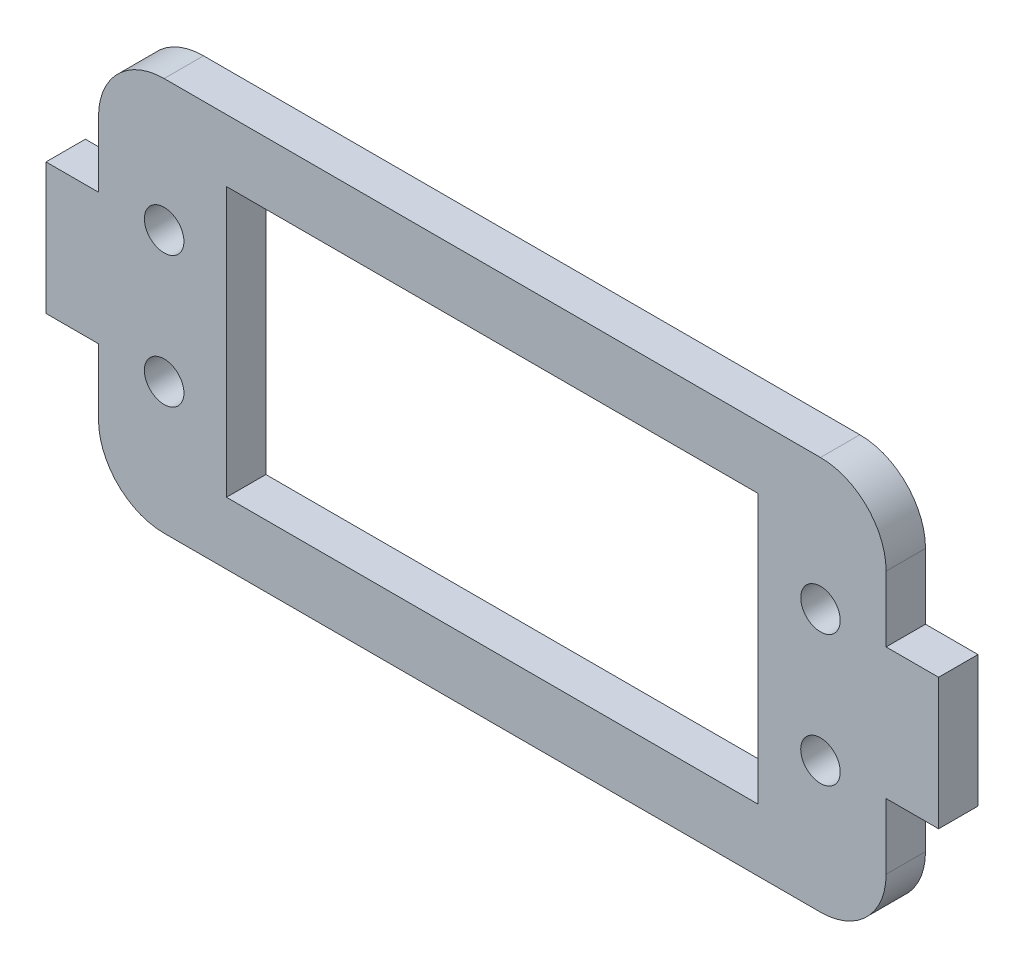
ISO-10303-21;
HEADER;
FILE_DESCRIPTION(('STEP AP214'),'2;1');
FILE_NAME('part.step','',(''),(''),'','','');
FILE_SCHEMA(('AUTOMOTIVE_DESIGN { 1 0 10303 214 1 1 1 1 }'));
ENDSEC;
DATA;
#1=APPLICATION_CONTEXT('core data for automotive mechanical design processes');
#2=APPLICATION_PROTOCOL_DEFINITION('international standard','automotive_design',2000,#1);
#3=PRODUCT_CONTEXT('',#1,'mechanical');
#4=PRODUCT('Part','Part','',(#3));
#5=PRODUCT_RELATED_PRODUCT_CATEGORY('part','',(#4));
#6=PRODUCT_DEFINITION_FORMATION('','',#4);
#7=PRODUCT_DEFINITION_CONTEXT('part definition',#1,'design');
#8=PRODUCT_DEFINITION('design','',#6,#7);
#9=PRODUCT_DEFINITION_SHAPE('','',#8);
#10=(LENGTH_UNIT() NAMED_UNIT(*) SI_UNIT(.MILLI.,.METRE.));
#11=(NAMED_UNIT(*) PLANE_ANGLE_UNIT() SI_UNIT($,.RADIAN.));
#12=(NAMED_UNIT(*) SI_UNIT($,.STERADIAN.) SOLID_ANGLE_UNIT());
#13=UNCERTAINTY_MEASURE_WITH_UNIT(LENGTH_MEASURE(1.E-05),#10,'distance_accuracy_value','');
#14=(GEOMETRIC_REPRESENTATION_CONTEXT(3) GLOBAL_UNCERTAINTY_ASSIGNED_CONTEXT((#13)) GLOBAL_UNIT_ASSIGNED_CONTEXT((#10,
#11,#12)) REPRESENTATION_CONTEXT('',''));
#15=CARTESIAN_POINT('',(0.,0.,0.));
#16=DIRECTION('',(0.,0.,1.));
#17=DIRECTION('',(1.,0.,0.));
#18=AXIS2_PLACEMENT_3D('',#15,#16,#17);
#19=CARTESIAN_POINT('',(30.,-4.99999999999998,3.));
#20=DIRECTION('',(-1.,0.,0.));
#21=DIRECTION('',(0.,0.,1.));
#22=AXIS2_PLACEMENT_3D('',#19,#20,#21);
#23=PLANE('',#22);
#24=DIRECTION('',(0.,1.,0.));
#25=VECTOR('',#24,1.);
#26=CARTESIAN_POINT('',(30.,-4.99999999999998,3.));
#27=LINE('',#26,#25);
#28=CARTESIAN_POINT('',(30.,-10.,3.));
#29=VERTEX_POINT('',#28);
#30=CARTESIAN_POINT('',(30.,-4.99999999999998,3.));
#31=VERTEX_POINT('',#30);
#32=EDGE_CURVE('E238',#29,#31,#27,.T.);
#33=ORIENTED_EDGE('',*,*,#32,.F.);
#34=DIRECTION('',(0.,0.,-1.));
#35=VECTOR('',#34,1.);
#36=CARTESIAN_POINT('',(30.,-10.,3.));
#37=LINE('',#36,#35);
#38=CARTESIAN_POINT('',(30.,-10.,0.));
#39=VERTEX_POINT('',#38);
#40=EDGE_CURVE('E346',#29,#39,#37,.T.);
#41=ORIENTED_EDGE('',*,*,#40,.T.);
#42=DIRECTION('',(0.,1.,0.));
#43=VECTOR('',#42,1.);
#44=CARTESIAN_POINT('',(30.,-4.99999999999998,0.));
#45=LINE('',#44,#43);
#46=CARTESIAN_POINT('',(30.,-4.99999999999998,0.));
#47=VERTEX_POINT('',#46);
#48=EDGE_CURVE('E205',#39,#47,#45,.T.);
#49=ORIENTED_EDGE('',*,*,#48,.T.);
#50=DIRECTION('',(0.,0.,-1.));
#51=VECTOR('',#50,1.);
#52=CARTESIAN_POINT('',(30.,-4.99999999999998,3.));
#53=LINE('',#52,#51);
#54=EDGE_CURVE('E342',#31,#47,#53,.T.);
#55=ORIENTED_EDGE('',*,*,#54,.F.);
#56=EDGE_LOOP('',(#33,#41,#49,#55));
#57=FACE_BOUND('',#56,.T.);
#58=ADVANCED_FACE('F42',(#57),#23,.F.);
#59=CARTESIAN_POINT('',(30.,-4.99999999999998,3.));
#60=DIRECTION('',(0.,1.,0.));
#61=DIRECTION('',(0.,0.,1.));
#62=AXIS2_PLACEMENT_3D('',#59,#60,#61);
#63=PLANE('',#62);
#64=DIRECTION('',(1.,0.,0.));
#65=VECTOR('',#64,1.);
#66=CARTESIAN_POINT('',(30.,-4.99999999999998,0.));
#67=LINE('',#66,#65);
#68=CARTESIAN_POINT('',(34.,-4.99999999999998,0.));
#69=VERTEX_POINT('',#68);
#70=EDGE_CURVE('E280',#47,#69,#67,.T.);
#71=ORIENTED_EDGE('',*,*,#70,.T.);
#72=DIRECTION('',(0.,0.,-1.));
#73=VECTOR('',#72,1.);
#74=CARTESIAN_POINT('',(34.,-4.99999999999998,3.));
#75=LINE('',#74,#73);
#76=CARTESIAN_POINT('',(34.,-4.99999999999998,3.));
#77=VERTEX_POINT('',#76);
#78=EDGE_CURVE('E338',#77,#69,#75,.T.);
#79=ORIENTED_EDGE('',*,*,#78,.F.);
#80=DIRECTION('',(1.,0.,0.));
#81=VECTOR('',#80,1.);
#82=CARTESIAN_POINT('',(30.,-4.99999999999998,3.));
#83=LINE('',#82,#81);
#84=EDGE_CURVE('E241',#31,#77,#83,.T.);
#85=ORIENTED_EDGE('',*,*,#84,.F.);
#86=ORIENTED_EDGE('',*,*,#54,.T.);
#87=EDGE_LOOP('',(#71,#79,#85,#86));
#88=FACE_BOUND('',#87,.T.);
#89=ADVANCED_FACE('F449',(#88),#63,.F.);
#90=CARTESIAN_POINT('',(34.,-4.99999999999998,3.));
#91=DIRECTION('',(-1.,0.,0.));
#92=DIRECTION('',(0.,0.,1.));
#93=AXIS2_PLACEMENT_3D('',#90,#91,#92);
#94=PLANE('',#93);
#95=DIRECTION('',(0.,1.,0.));
#96=VECTOR('',#95,1.);
#97=CARTESIAN_POINT('',(34.,-4.99999999999998,0.));
#98=LINE('',#97,#96);
#99=CARTESIAN_POINT('',(34.,5.00000000000002,0.));
#100=VERTEX_POINT('',#99);
#101=EDGE_CURVE('E283',#69,#100,#98,.T.);
#102=ORIENTED_EDGE('',*,*,#101,.T.);
#103=DIRECTION('',(0.,0.,-1.));
#104=VECTOR('',#103,1.);
#105=CARTESIAN_POINT('',(34.,5.00000000000002,3.));
#106=LINE('',#105,#104);
#107=CARTESIAN_POINT('',(34.,5.00000000000002,3.));
#108=VERTEX_POINT('',#107);
#109=EDGE_CURVE('E334',#108,#100,#106,.T.);
#110=ORIENTED_EDGE('',*,*,#109,.F.);
#111=DIRECTION('',(0.,1.,0.));
#112=VECTOR('',#111,1.);
#113=CARTESIAN_POINT('',(34.,-4.99999999999998,3.));
#114=LINE('',#113,#112);
#115=EDGE_CURVE('E245',#77,#108,#114,.T.);
#116=ORIENTED_EDGE('',*,*,#115,.F.);
#117=ORIENTED_EDGE('',*,*,#78,.T.);
#118=EDGE_LOOP('',(#102,#110,#116,#117));
#119=FACE_BOUND('',#118,.T.);
#120=ADVANCED_FACE('F454',(#119),#94,.F.);
#121=CARTESIAN_POINT('',(30.,5.00000000000002,3.));
#122=DIRECTION('',(0.,-1.,0.));
#123=DIRECTION('',(0.,0.,-1.));
#124=AXIS2_PLACEMENT_3D('',#121,#122,#123);
#125=PLANE('',#124);
#126=DIRECTION('',(-1.,0.,0.));
#127=VECTOR('',#126,1.);
#128=CARTESIAN_POINT('',(30.,5.00000000000002,0.));
#129=LINE('',#128,#127);
#130=CARTESIAN_POINT('',(30.,5.00000000000002,0.));
#131=VERTEX_POINT('',#130);
#132=EDGE_CURVE('E286',#100,#131,#129,.T.);
#133=ORIENTED_EDGE('',*,*,#132,.T.);
#134=DIRECTION('',(0.,0.,-1.));
#135=VECTOR('',#134,1.);
#136=CARTESIAN_POINT('',(30.,5.00000000000002,3.));
#137=LINE('',#136,#135);
#138=CARTESIAN_POINT('',(30.,5.00000000000002,3.));
#139=VERTEX_POINT('',#138);
#140=EDGE_CURVE('E330',#139,#131,#137,.T.);
#141=ORIENTED_EDGE('',*,*,#140,.F.);
#142=DIRECTION('',(-1.,0.,0.));
#143=VECTOR('',#142,1.);
#144=CARTESIAN_POINT('',(30.,5.00000000000002,3.));
#145=LINE('',#144,#143);
#146=EDGE_CURVE('E248',#108,#139,#145,.T.);
#147=ORIENTED_EDGE('',*,*,#146,.F.);
#148=ORIENTED_EDGE('',*,*,#109,.T.);
#149=EDGE_LOOP('',(#133,#141,#147,#148));
#150=FACE_BOUND('',#149,.T.);
#151=ADVANCED_FACE('F457',(#150),#125,.F.);
#152=CARTESIAN_POINT('',(30.,15.,3.));
#153=DIRECTION('',(-1.,0.,0.));
#154=DIRECTION('',(0.,0.,1.));
#155=AXIS2_PLACEMENT_3D('',#152,#153,#154);
#156=PLANE('',#155);
#157=DIRECTION('',(0.,1.,0.));
#158=VECTOR('',#157,1.);
#159=CARTESIAN_POINT('',(30.,15.,0.));
#160=LINE('',#159,#158);
#161=CARTESIAN_POINT('',(30.,10.,0.));
#162=VERTEX_POINT('',#161);
#163=EDGE_CURVE('E289',#131,#162,#160,.T.);
#164=ORIENTED_EDGE('',*,*,#163,.T.);
#165=DIRECTION('',(0.,0.,-1.));
#166=VECTOR('',#165,1.);
#167=CARTESIAN_POINT('',(30.,10.,3.));
#168=LINE('',#167,#166);
#169=CARTESIAN_POINT('',(30.,10.,3.));
#170=VERTEX_POINT('',#169);
#171=EDGE_CURVE('E51',#162,#170,#168,.F.);
#172=ORIENTED_EDGE('',*,*,#171,.T.);
#173=DIRECTION('',(0.,1.,0.));
#174=VECTOR('',#173,1.);
#175=CARTESIAN_POINT('',(30.,15.,3.));
#176=LINE('',#175,#174);
#177=EDGE_CURVE('E251',#139,#170,#176,.T.);
#178=ORIENTED_EDGE('',*,*,#177,.F.);
#179=ORIENTED_EDGE('',*,*,#140,.T.);
#180=EDGE_LOOP('',(#164,#172,#178,#179));
#181=FACE_BOUND('',#180,.T.);
#182=ADVANCED_FACE('F392',(#181),#156,.F.);
#183=CARTESIAN_POINT('',(-30.,15.,3.));
#184=DIRECTION('',(0.,-1.,0.));
#185=DIRECTION('',(0.,0.,-1.));
#186=AXIS2_PLACEMENT_3D('',#183,#184,#185);
#187=PLANE('',#186);
#188=DIRECTION('',(-1.,0.,0.));
#189=VECTOR('',#188,1.);
#190=CARTESIAN_POINT('',(-30.,15.,3.));
#191=LINE('',#190,#189);
#192=CARTESIAN_POINT('',(25.,15.,3.));
#193=VERTEX_POINT('',#192);
#194=CARTESIAN_POINT('',(-25.,15.,3.));
#195=VERTEX_POINT('',#194);
#196=EDGE_CURVE('E255',#193,#195,#191,.T.);
#197=ORIENTED_EDGE('',*,*,#196,.F.);
#198=DIRECTION('',(0.,0.,-1.));
#199=VECTOR('',#198,1.);
#200=CARTESIAN_POINT('',(25.,15.,3.));
#201=LINE('',#200,#199);
#202=CARTESIAN_POINT('',(25.,15.,0.));
#203=VERTEX_POINT('',#202);
#204=EDGE_CURVE('E385',#193,#203,#201,.T.);
#205=ORIENTED_EDGE('',*,*,#204,.T.);
#206=DIRECTION('',(-1.,0.,0.));
#207=VECTOR('',#206,1.);
#208=CARTESIAN_POINT('',(-30.,15.,0.));
#209=LINE('',#208,#207);
#210=CARTESIAN_POINT('',(-25.,15.,0.));
#211=VERTEX_POINT('',#210);
#212=EDGE_CURVE('E293',#203,#211,#209,.T.);
#213=ORIENTED_EDGE('',*,*,#212,.T.);
#214=DIRECTION('',(0.,0.,-1.));
#215=VECTOR('',#214,1.);
#216=CARTESIAN_POINT('',(-25.,15.,3.));
#217=LINE('',#216,#215);
#218=EDGE_CURVE('E382',#211,#195,#217,.F.);
#219=ORIENTED_EDGE('',*,*,#218,.T.);
#220=EDGE_LOOP('',(#197,#205,#213,#219));
#221=FACE_BOUND('',#220,.T.);
#222=ADVANCED_FACE('F404',(#221),#187,.F.);
#223=CARTESIAN_POINT('',(-30.,15.,3.));
#224=DIRECTION('',(1.,0.,0.));
#225=DIRECTION('',(0.,0.,-1.));
#226=AXIS2_PLACEMENT_3D('',#223,#224,#225);
#227=PLANE('',#226);
#228=DIRECTION('',(0.,-1.,0.));
#229=VECTOR('',#228,1.);
#230=CARTESIAN_POINT('',(-30.,15.,3.));
#231=LINE('',#230,#229);
#232=CARTESIAN_POINT('',(-30.,10.,3.));
#233=VERTEX_POINT('',#232);
#234=CARTESIAN_POINT('',(-30.,5.,3.));
#235=VERTEX_POINT('',#234);
#236=EDGE_CURVE('E258',#233,#235,#231,.T.);
#237=ORIENTED_EDGE('',*,*,#236,.F.);
#238=DIRECTION('',(0.,0.,-1.));
#239=VECTOR('',#238,1.);
#240=CARTESIAN_POINT('',(-30.,10.,3.));
#241=LINE('',#240,#239);
#242=CARTESIAN_POINT('',(-30.,10.,0.));
#243=VERTEX_POINT('',#242);
#244=EDGE_CURVE('E11',#233,#243,#241,.T.);
#245=ORIENTED_EDGE('',*,*,#244,.T.);
#246=DIRECTION('',(0.,-1.,0.));
#247=VECTOR('',#246,1.);
#248=CARTESIAN_POINT('',(-30.,15.,0.));
#249=LINE('',#248,#247);
#250=CARTESIAN_POINT('',(-30.,5.,0.));
#251=VERTEX_POINT('',#250);
#252=EDGE_CURVE('E297',#243,#251,#249,.T.);
#253=ORIENTED_EDGE('',*,*,#252,.T.);
#254=DIRECTION('',(0.,0.,-1.));
#255=VECTOR('',#254,1.);
#256=CARTESIAN_POINT('',(-30.,5.,3.));
#257=LINE('',#256,#255);
#258=EDGE_CURVE('E326',#235,#251,#257,.T.);
#259=ORIENTED_EDGE('',*,*,#258,.F.);
#260=EDGE_LOOP('',(#237,#245,#253,#259));
#261=FACE_BOUND('',#260,.T.);
#262=ADVANCED_FACE('F412',(#261),#227,.F.);
#263=CARTESIAN_POINT('',(-30.,5.,3.));
#264=DIRECTION('',(0.,-1.,0.));
#265=DIRECTION('',(1.,0.,0.));
#266=AXIS2_PLACEMENT_3D('',#263,#264,#265);
#267=PLANE('',#266);
#268=DIRECTION('',(-1.,0.,0.));
#269=VECTOR('',#268,1.);
#270=CARTESIAN_POINT('',(-30.,5.,0.));
#271=LINE('',#270,#269);
#272=CARTESIAN_POINT('',(-34.,5.,0.));
#273=VERTEX_POINT('',#272);
#274=EDGE_CURVE('E300',#251,#273,#271,.T.);
#275=ORIENTED_EDGE('',*,*,#274,.T.);
#276=DIRECTION('',(0.,0.,-1.));
#277=VECTOR('',#276,1.);
#278=CARTESIAN_POINT('',(-34.,5.,3.));
#279=LINE('',#278,#277);
#280=CARTESIAN_POINT('',(-34.,5.,3.));
#281=VERTEX_POINT('',#280);
#282=EDGE_CURVE('E322',#281,#273,#279,.T.);
#283=ORIENTED_EDGE('',*,*,#282,.F.);
#284=DIRECTION('',(-1.,0.,0.));
#285=VECTOR('',#284,1.);
#286=CARTESIAN_POINT('',(-30.,5.,3.));
#287=LINE('',#286,#285);
#288=EDGE_CURVE('E261',#235,#281,#287,.T.);
#289=ORIENTED_EDGE('',*,*,#288,.F.);
#290=ORIENTED_EDGE('',*,*,#258,.T.);
#291=EDGE_LOOP('',(#275,#283,#289,#290));
#292=FACE_BOUND('',#291,.T.);
#293=ADVANCED_FACE('F419',(#292),#267,.F.);
#294=CARTESIAN_POINT('',(-34.,-5.,3.));
#295=DIRECTION('',(1.,0.,0.));
#296=DIRECTION('',(0.,0.,-1.));
#297=AXIS2_PLACEMENT_3D('',#294,#295,#296);
#298=PLANE('',#297);
#299=DIRECTION('',(0.,-1.,0.));
#300=VECTOR('',#299,1.);
#301=CARTESIAN_POINT('',(-34.,-5.,0.));
#302=LINE('',#301,#300);
#303=CARTESIAN_POINT('',(-34.,-5.,0.));
#304=VERTEX_POINT('',#303);
#305=EDGE_CURVE('E303',#273,#304,#302,.T.);
#306=ORIENTED_EDGE('',*,*,#305,.T.);
#307=DIRECTION('',(0.,0.,-1.));
#308=VECTOR('',#307,1.);
#309=CARTESIAN_POINT('',(-34.,-5.,3.));
#310=LINE('',#309,#308);
#311=CARTESIAN_POINT('',(-34.,-5.,3.));
#312=VERTEX_POINT('',#311);
#313=EDGE_CURVE('E318',#312,#304,#310,.T.);
#314=ORIENTED_EDGE('',*,*,#313,.F.);
#315=DIRECTION('',(0.,-1.,0.));
#316=VECTOR('',#315,1.);
#317=CARTESIAN_POINT('',(-34.,-5.,3.));
#318=LINE('',#317,#316);
#319=EDGE_CURVE('E264',#281,#312,#318,.T.);
#320=ORIENTED_EDGE('',*,*,#319,.F.);
#321=ORIENTED_EDGE('',*,*,#282,.T.);
#322=EDGE_LOOP('',(#306,#314,#320,#321));
#323=FACE_BOUND('',#322,.T.);
#324=ADVANCED_FACE('F422',(#323),#298,.F.);
#325=CARTESIAN_POINT('',(-30.,-5.,3.));
#326=DIRECTION('',(0.,1.,0.));
#327=DIRECTION('',(-1.,0.,0.));
#328=AXIS2_PLACEMENT_3D('',#325,#326,#327);
#329=PLANE('',#328);
#330=DIRECTION('',(1.,0.,0.));
#331=VECTOR('',#330,1.);
#332=CARTESIAN_POINT('',(-30.,-5.,0.));
#333=LINE('',#332,#331);
#334=CARTESIAN_POINT('',(-30.,-5.,0.));
#335=VERTEX_POINT('',#334);
#336=EDGE_CURVE('E306',#304,#335,#333,.T.);
#337=ORIENTED_EDGE('',*,*,#336,.T.);
#338=DIRECTION('',(0.,0.,-1.));
#339=VECTOR('',#338,1.);
#340=CARTESIAN_POINT('',(-30.,-5.,3.));
#341=LINE('',#340,#339);
#342=CARTESIAN_POINT('',(-30.,-5.,3.));
#343=VERTEX_POINT('',#342);
#344=EDGE_CURVE('E277',#343,#335,#341,.T.);
#345=ORIENTED_EDGE('',*,*,#344,.F.);
#346=DIRECTION('',(1.,0.,0.));
#347=VECTOR('',#346,1.);
#348=CARTESIAN_POINT('',(-30.,-5.,3.));
#349=LINE('',#348,#347);
#350=EDGE_CURVE('E267',#312,#343,#349,.T.);
#351=ORIENTED_EDGE('',*,*,#350,.F.);
#352=ORIENTED_EDGE('',*,*,#313,.T.);
#353=EDGE_LOOP('',(#337,#345,#351,#352));
#354=FACE_BOUND('',#353,.T.);
#355=ADVANCED_FACE('F427',(#354),#329,.F.);
#356=CARTESIAN_POINT('',(-30.,-5.,3.));
#357=DIRECTION('',(1.,0.,0.));
#358=DIRECTION('',(0.,0.,-1.));
#359=AXIS2_PLACEMENT_3D('',#356,#357,#358);
#360=PLANE('',#359);
#361=DIRECTION('',(0.,-1.,0.));
#362=VECTOR('',#361,1.);
#363=CARTESIAN_POINT('',(-30.,-5.,0.));
#364=LINE('',#363,#362);
#365=CARTESIAN_POINT('',(-30.,-10.,0.));
#366=VERTEX_POINT('',#365);
#367=EDGE_CURVE('E309',#335,#366,#364,.T.);
#368=ORIENTED_EDGE('',*,*,#367,.T.);
#369=DIRECTION('',(0.,0.,-1.));
#370=VECTOR('',#369,1.);
#371=CARTESIAN_POINT('',(-30.,-10.,3.));
#372=LINE('',#371,#370);
#373=CARTESIAN_POINT('',(-30.,-10.,3.));
#374=VERTEX_POINT('',#373);
#375=EDGE_CURVE('E58',#366,#374,#372,.F.);
#376=ORIENTED_EDGE('',*,*,#375,.T.);
#377=DIRECTION('',(0.,-1.,0.));
#378=VECTOR('',#377,1.);
#379=CARTESIAN_POINT('',(-30.,-5.,3.));
#380=LINE('',#379,#378);
#381=EDGE_CURVE('E270',#343,#374,#380,.T.);
#382=ORIENTED_EDGE('',*,*,#381,.F.);
#383=ORIENTED_EDGE('',*,*,#344,.T.);
#384=EDGE_LOOP('',(#368,#376,#382,#383));
#385=FACE_BOUND('',#384,.T.);
#386=ADVANCED_FACE('F536',(#385),#360,.F.);
#387=CARTESIAN_POINT('',(-30.,-15.,3.));
#388=DIRECTION('',(0.,1.,0.));
#389=DIRECTION('',(0.,0.,1.));
#390=AXIS2_PLACEMENT_3D('',#387,#388,#389);
#391=PLANE('',#390);
#392=DIRECTION('',(1.,0.,0.));
#393=VECTOR('',#392,1.);
#394=CARTESIAN_POINT('',(-30.,-15.,0.));
#395=LINE('',#394,#393);
#396=CARTESIAN_POINT('',(-25.,-15.,0.));
#397=VERTEX_POINT('',#396);
#398=CARTESIAN_POINT('',(25.,-15.,0.));
#399=VERTEX_POINT('',#398);
#400=EDGE_CURVE('E242',#397,#399,#395,.T.);
#401=ORIENTED_EDGE('',*,*,#400,.T.);
#402=DIRECTION('',(0.,0.,-1.));
#403=VECTOR('',#402,1.);
#404=CARTESIAN_POINT('',(25.,-15.,3.));
#405=LINE('',#404,#403);
#406=CARTESIAN_POINT('',(25.,-15.,3.));
#407=VERTEX_POINT('',#406);
#408=EDGE_CURVE('E366',#399,#407,#405,.F.);
#409=ORIENTED_EDGE('',*,*,#408,.T.);
#410=DIRECTION('',(1.,0.,0.));
#411=VECTOR('',#410,1.);
#412=CARTESIAN_POINT('',(-30.,-15.,3.));
#413=LINE('',#412,#411);
#414=CARTESIAN_POINT('',(-25.,-15.,3.));
#415=VERTEX_POINT('',#414);
#416=EDGE_CURVE('E273',#415,#407,#413,.T.);
#417=ORIENTED_EDGE('',*,*,#416,.F.);
#418=DIRECTION('',(0.,0.,-1.));
#419=VECTOR('',#418,1.);
#420=CARTESIAN_POINT('',(-25.,-15.,3.));
#421=LINE('',#420,#419);
#422=EDGE_CURVE('E362',#415,#397,#421,.T.);
#423=ORIENTED_EDGE('',*,*,#422,.T.);
#424=EDGE_LOOP('',(#401,#409,#417,#423));
#425=FACE_BOUND('',#424,.T.);
#426=ADVANCED_FACE('F435',(#425),#391,.F.);
#427=CARTESIAN_POINT('',(0.,0.,3.));
#428=DIRECTION('',(0.,0.,1.));
#429=DIRECTION('',(1.,0.,0.));
#430=AXIS2_PLACEMENT_3D('',#427,#428,#429);
#431=PLANE('',#430);
#432=CARTESIAN_POINT('',(-25.,-5.,3.));
#433=DIRECTION('',(0.,0.,1.));
#434=DIRECTION('',(1.,0.,0.));
#435=AXIS2_PLACEMENT_3D('',#432,#433,#434);
#436=CIRCLE('',#435,1.50521963135972);
#437=CARTESIAN_POINT('',(-23.4947803686403,-5.,3.));
#438=VERTEX_POINT('',#437);
#439=EDGE_CURVE('E738',#438,#438,#436,.T.);
#440=ORIENTED_EDGE('',*,*,#439,.F.);
#441=EDGE_LOOP('',(#440));
#442=FACE_BOUND('',#441,.T.);
#443=CARTESIAN_POINT('',(25.,-5.,3.));
#444=DIRECTION('',(0.,0.,1.));
#445=DIRECTION('',(-1.,0.,0.));
#446=AXIS2_PLACEMENT_3D('',#443,#444,#445);
#447=CIRCLE('',#446,1.50521963135972);
#448=CARTESIAN_POINT('',(23.4947803686403,-5.,3.));
#449=VERTEX_POINT('',#448);
#450=EDGE_CURVE('E747',#449,#449,#447,.T.);
#451=ORIENTED_EDGE('',*,*,#450,.F.);
#452=EDGE_LOOP('',(#451));
#453=FACE_BOUND('',#452,.T.);
#454=CARTESIAN_POINT('',(-25.,5.,3.));
#455=DIRECTION('',(0.,0.,1.));
#456=DIRECTION('',(-1.,0.,0.));
#457=AXIS2_PLACEMENT_3D('',#454,#455,#456);
#458=CIRCLE('',#457,1.50521963135972);
#459=CARTESIAN_POINT('',(-26.5052196313597,5.,3.));
#460=VERTEX_POINT('',#459);
#461=EDGE_CURVE('E755',#460,#460,#458,.T.);
#462=ORIENTED_EDGE('',*,*,#461,.F.);
#463=EDGE_LOOP('',(#462));
#464=FACE_BOUND('',#463,.T.);
#465=CARTESIAN_POINT('',(25.,5.,3.));
#466=DIRECTION('',(0.,0.,1.));
#467=DIRECTION('',(1.,0.,0.));
#468=AXIS2_PLACEMENT_3D('',#465,#466,#467);
#469=CIRCLE('',#468,1.50521963135972);
#470=CARTESIAN_POINT('',(26.5052196313597,5.,3.));
#471=VERTEX_POINT('',#470);
#472=EDGE_CURVE('E732',#471,#471,#469,.T.);
#473=ORIENTED_EDGE('',*,*,#472,.F.);
#474=EDGE_LOOP('',(#473));
#475=FACE_BOUND('',#474,.T.);
#476=DIRECTION('',(0.,1.,0.));
#477=VECTOR('',#476,1.);
#478=CARTESIAN_POINT('',(20.25,10.25,3.));
#479=LINE('',#478,#477);
#480=CARTESIAN_POINT('',(20.25,-10.25,3.));
#481=VERTEX_POINT('',#480);
#482=CARTESIAN_POINT('',(20.25,10.25,3.));
#483=VERTEX_POINT('',#482);
#484=EDGE_CURVE('E190',#481,#483,#479,.T.);
#485=ORIENTED_EDGE('',*,*,#484,.F.);
#486=DIRECTION('',(1.,0.,0.));
#487=VECTOR('',#486,1.);
#488=CARTESIAN_POINT('',(-20.25,-10.25,3.));
#489=LINE('',#488,#487);
#490=CARTESIAN_POINT('',(-20.25,-10.25,3.));
#491=VERTEX_POINT('',#490);
#492=EDGE_CURVE('E196',#491,#481,#489,.T.);
#493=ORIENTED_EDGE('',*,*,#492,.F.);
#494=DIRECTION('',(0.,-1.,0.));
#495=VECTOR('',#494,1.);
#496=CARTESIAN_POINT('',(-20.25,10.25,3.));
#497=LINE('',#496,#495);
#498=CARTESIAN_POINT('',(-20.25,10.25,3.));
#499=VERTEX_POINT('',#498);
#500=EDGE_CURVE('E224',#499,#491,#497,.T.);
#501=ORIENTED_EDGE('',*,*,#500,.F.);
#502=DIRECTION('',(-1.,0.,0.));
#503=VECTOR('',#502,1.);
#504=CARTESIAN_POINT('',(-20.25,10.25,3.));
#505=LINE('',#504,#503);
#506=EDGE_CURVE('E216',#483,#499,#505,.T.);
#507=ORIENTED_EDGE('',*,*,#506,.F.);
#508=EDGE_LOOP('',(#485,#493,#501,#507));
#509=FACE_BOUND('',#508,.T.);
#510=ORIENTED_EDGE('',*,*,#416,.T.);
#511=CARTESIAN_POINT('',(25.,-10.,3.));
#512=DIRECTION('',(0.,0.,1.));
#513=DIRECTION('',(1.,0.,0.));
#514=AXIS2_PLACEMENT_3D('',#511,#512,#513);
#515=CIRCLE('',#514,5.);
#516=EDGE_CURVE('E377',#407,#29,#515,.T.);
#517=ORIENTED_EDGE('',*,*,#516,.T.);
#518=ORIENTED_EDGE('',*,*,#32,.T.);
#519=ORIENTED_EDGE('',*,*,#84,.T.);
#520=ORIENTED_EDGE('',*,*,#115,.T.);
#521=ORIENTED_EDGE('',*,*,#146,.T.);
#522=ORIENTED_EDGE('',*,*,#177,.T.);
#523=CARTESIAN_POINT('',(25.,10.,3.));
#524=DIRECTION('',(0.,0.,1.));
#525=DIRECTION('',(1.,0.,0.));
#526=AXIS2_PLACEMENT_3D('',#523,#524,#525);
#527=CIRCLE('',#526,5.);
#528=EDGE_CURVE('E371',#170,#193,#527,.T.);
#529=ORIENTED_EDGE('',*,*,#528,.T.);
#530=ORIENTED_EDGE('',*,*,#196,.T.);
#531=CARTESIAN_POINT('',(-25.,10.,3.));
#532=DIRECTION('',(0.,0.,1.));
#533=DIRECTION('',(1.,0.,0.));
#534=AXIS2_PLACEMENT_3D('',#531,#532,#533);
#535=CIRCLE('',#534,5.);
#536=EDGE_CURVE('E66',#195,#233,#535,.T.);
#537=ORIENTED_EDGE('',*,*,#536,.T.);
#538=ORIENTED_EDGE('',*,*,#236,.T.);
#539=ORIENTED_EDGE('',*,*,#288,.T.);
#540=ORIENTED_EDGE('',*,*,#319,.T.);
#541=ORIENTED_EDGE('',*,*,#350,.T.);
#542=ORIENTED_EDGE('',*,*,#381,.T.);
#543=CARTESIAN_POINT('',(-25.,-10.,3.));
#544=DIRECTION('',(0.,0.,1.));
#545=DIRECTION('',(1.,0.,0.));
#546=AXIS2_PLACEMENT_3D('',#543,#544,#545);
#547=CIRCLE('',#546,5.);
#548=EDGE_CURVE('E374',#374,#415,#547,.T.);
#549=ORIENTED_EDGE('',*,*,#548,.T.);
#550=EDGE_LOOP('',(#510,#517,#518,#519,#520,#521,#522,#529,#530,#537,#538,#539,#540,#541,#542,#549));
#551=FACE_BOUND('',#550,.T.);
#552=ADVANCED_FACE('F396',(#442,#453,#464,#475,#509,#551),#431,.T.);
#553=CARTESIAN_POINT('',(0.,0.,0.));
#554=DIRECTION('',(0.,0.,1.));
#555=DIRECTION('',(1.,0.,0.));
#556=AXIS2_PLACEMENT_3D('',#553,#554,#555);
#557=PLANE('',#556);
#558=CARTESIAN_POINT('',(-25.,-5.,0.));
#559=DIRECTION('',(0.,0.,1.));
#560=DIRECTION('',(1.,0.,0.));
#561=AXIS2_PLACEMENT_3D('',#558,#559,#560);
#562=CIRCLE('',#561,1.50521963135972);
#563=CARTESIAN_POINT('',(-23.4947803686403,-5.,0.));
#564=VERTEX_POINT('',#563);
#565=EDGE_CURVE('E743',#564,#564,#562,.F.);
#566=ORIENTED_EDGE('',*,*,#565,.F.);
#567=EDGE_LOOP('',(#566));
#568=FACE_BOUND('',#567,.T.);
#569=CARTESIAN_POINT('',(25.,-5.,0.));
#570=DIRECTION('',(0.,0.,1.));
#571=DIRECTION('',(1.,0.,0.));
#572=AXIS2_PLACEMENT_3D('',#569,#570,#571);
#573=CIRCLE('',#572,1.50521963135972);
#574=CARTESIAN_POINT('',(26.5052196313597,-5.,0.));
#575=VERTEX_POINT('',#574);
#576=EDGE_CURVE('E742',#575,#575,#573,.F.);
#577=ORIENTED_EDGE('',*,*,#576,.F.);
#578=EDGE_LOOP('',(#577));
#579=FACE_BOUND('',#578,.T.);
#580=CARTESIAN_POINT('',(-25.,5.,0.));
#581=DIRECTION('',(0.,0.,1.));
#582=DIRECTION('',(1.,0.,0.));
#583=AXIS2_PLACEMENT_3D('',#580,#581,#582);
#584=CIRCLE('',#583,1.50521963135972);
#585=CARTESIAN_POINT('',(-23.4947803686403,5.,0.));
#586=VERTEX_POINT('',#585);
#587=EDGE_CURVE('E751',#586,#586,#584,.F.);
#588=ORIENTED_EDGE('',*,*,#587,.F.);
#589=EDGE_LOOP('',(#588));
#590=FACE_BOUND('',#589,.T.);
#591=CARTESIAN_POINT('',(25.,5.,0.));
#592=DIRECTION('',(0.,0.,1.));
#593=DIRECTION('',(1.,0.,0.));
#594=AXIS2_PLACEMENT_3D('',#591,#592,#593);
#595=CIRCLE('',#594,1.50521963135972);
#596=CARTESIAN_POINT('',(26.5052196313597,5.,0.));
#597=VERTEX_POINT('',#596);
#598=EDGE_CURVE('E735',#597,#597,#595,.F.);
#599=ORIENTED_EDGE('',*,*,#598,.F.);
#600=EDGE_LOOP('',(#599));
#601=FACE_BOUND('',#600,.T.);
#602=DIRECTION('',(-1.,0.,0.));
#603=VECTOR('',#602,1.);
#604=CARTESIAN_POINT('',(-20.25,-10.25,0.));
#605=LINE('',#604,#603);
#606=CARTESIAN_POINT('',(20.25,-10.25,0.));
#607=VERTEX_POINT('',#606);
#608=CARTESIAN_POINT('',(-20.25,-10.25,0.));
#609=VERTEX_POINT('',#608);
#610=EDGE_CURVE('E211',#607,#609,#605,.T.);
#611=ORIENTED_EDGE('',*,*,#610,.F.);
#612=DIRECTION('',(0.,-1.,0.));
#613=VECTOR('',#612,1.);
#614=CARTESIAN_POINT('',(20.25,10.25,0.));
#615=LINE('',#614,#613);
#616=CARTESIAN_POINT('',(20.25,10.25,0.));
#617=VERTEX_POINT('',#616);
#618=EDGE_CURVE('E187',#617,#607,#615,.T.);
#619=ORIENTED_EDGE('',*,*,#618,.F.);
#620=DIRECTION('',(1.,0.,0.));
#621=VECTOR('',#620,1.);
#622=CARTESIAN_POINT('',(-20.25,10.25,0.));
#623=LINE('',#622,#621);
#624=CARTESIAN_POINT('',(-20.25,10.25,0.));
#625=VERTEX_POINT('',#624);
#626=EDGE_CURVE('E200',#625,#617,#623,.T.);
#627=ORIENTED_EDGE('',*,*,#626,.F.);
#628=DIRECTION('',(0.,1.,0.));
#629=VECTOR('',#628,1.);
#630=CARTESIAN_POINT('',(-20.25,10.25,0.));
#631=LINE('',#630,#629);
#632=EDGE_CURVE('E218',#609,#625,#631,.T.);
#633=ORIENTED_EDGE('',*,*,#632,.F.);
#634=EDGE_LOOP('',(#611,#619,#627,#633));
#635=FACE_BOUND('',#634,.T.);
#636=ORIENTED_EDGE('',*,*,#48,.F.);
#637=CARTESIAN_POINT('',(25.,-10.,0.));
#638=DIRECTION('',(0.,0.,1.));
#639=DIRECTION('',(1.,0.,0.));
#640=AXIS2_PLACEMENT_3D('',#637,#638,#639);
#641=CIRCLE('',#640,5.);
#642=EDGE_CURVE('E359',#39,#399,#641,.F.);
#643=ORIENTED_EDGE('',*,*,#642,.T.);
#644=ORIENTED_EDGE('',*,*,#400,.F.);
#645=CARTESIAN_POINT('',(-25.,-10.,0.));
#646=DIRECTION('',(0.,0.,1.));
#647=DIRECTION('',(1.,0.,0.));
#648=AXIS2_PLACEMENT_3D('',#645,#646,#647);
#649=CIRCLE('',#648,5.);
#650=EDGE_CURVE('E356',#397,#366,#649,.F.);
#651=ORIENTED_EDGE('',*,*,#650,.T.);
#652=ORIENTED_EDGE('',*,*,#367,.F.);
#653=ORIENTED_EDGE('',*,*,#336,.F.);
#654=ORIENTED_EDGE('',*,*,#305,.F.);
#655=ORIENTED_EDGE('',*,*,#274,.F.);
#656=ORIENTED_EDGE('',*,*,#252,.F.);
#657=CARTESIAN_POINT('',(-25.,10.,0.));
#658=DIRECTION('',(0.,0.,1.));
#659=DIRECTION('',(1.,0.,0.));
#660=AXIS2_PLACEMENT_3D('',#657,#658,#659);
#661=CIRCLE('',#660,5.);
#662=EDGE_CURVE('E350',#243,#211,#661,.F.);
#663=ORIENTED_EDGE('',*,*,#662,.T.);
#664=ORIENTED_EDGE('',*,*,#212,.F.);
#665=CARTESIAN_POINT('',(25.,10.,0.));
#666=DIRECTION('',(0.,0.,1.));
#667=DIRECTION('',(1.,0.,0.));
#668=AXIS2_PLACEMENT_3D('',#665,#666,#667);
#669=CIRCLE('',#668,5.);
#670=EDGE_CURVE('E353',#203,#162,#669,.F.);
#671=ORIENTED_EDGE('',*,*,#670,.T.);
#672=ORIENTED_EDGE('',*,*,#163,.F.);
#673=ORIENTED_EDGE('',*,*,#132,.F.);
#674=ORIENTED_EDGE('',*,*,#101,.F.);
#675=ORIENTED_EDGE('',*,*,#70,.F.);
#676=EDGE_LOOP('',(#636,#643,#644,#651,#652,#653,#654,#655,#656,#663,#664,#671,#672,#673,#674,#675));
#677=FACE_BOUND('',#676,.T.);
#678=ADVANCED_FACE('F208',(#568,#579,#590,#601,#635,#677),#557,.F.);
#679=CARTESIAN_POINT('',(20.25,10.25,-0.00100000000000013));
#680=DIRECTION('',(1.,0.,0.));
#681=DIRECTION('',(0.,1.,0.));
#682=AXIS2_PLACEMENT_3D('',#679,#680,#681);
#683=PLANE('',#682);
#684=ORIENTED_EDGE('',*,*,#618,.T.);
#685=DIRECTION('',(0.,0.,1.));
#686=VECTOR('',#685,1.);
#687=CARTESIAN_POINT('',(20.25,-10.25,-0.00100000000000013));
#688=LINE('',#687,#686);
#689=EDGE_CURVE('E206',#607,#481,#688,.T.);
#690=ORIENTED_EDGE('',*,*,#689,.T.);
#691=ORIENTED_EDGE('',*,*,#484,.T.);
#692=DIRECTION('',(0.,0.,1.));
#693=VECTOR('',#692,1.);
#694=CARTESIAN_POINT('',(20.25,10.25,-0.00100000000000013));
#695=LINE('',#694,#693);
#696=EDGE_CURVE('E183',#617,#483,#695,.T.);
#697=ORIENTED_EDGE('',*,*,#696,.F.);
#698=EDGE_LOOP('',(#684,#690,#691,#697));
#699=FACE_BOUND('',#698,.T.);
#700=ADVANCED_FACE('F185',(#699),#683,.F.);
#701=CARTESIAN_POINT('',(-20.25,-10.25,-0.00100000000000013));
#702=DIRECTION('',(0.,-1.,0.));
#703=DIRECTION('',(0.,0.,-1.));
#704=AXIS2_PLACEMENT_3D('',#701,#702,#703);
#705=PLANE('',#704);
#706=ORIENTED_EDGE('',*,*,#610,.T.);
#707=DIRECTION('',(0.,0.,1.));
#708=VECTOR('',#707,1.);
#709=CARTESIAN_POINT('',(-20.25,-10.25,-0.00100000000000013));
#710=LINE('',#709,#708);
#711=EDGE_CURVE('E233',#609,#491,#710,.T.);
#712=ORIENTED_EDGE('',*,*,#711,.T.);
#713=ORIENTED_EDGE('',*,*,#492,.T.);
#714=ORIENTED_EDGE('',*,*,#689,.F.);
#715=EDGE_LOOP('',(#706,#712,#713,#714));
#716=FACE_BOUND('',#715,.T.);
#717=ADVANCED_FACE('F642',(#716),#705,.F.);
#718=CARTESIAN_POINT('',(-20.25,10.25,-0.00100000000000013));
#719=DIRECTION('',(-1.,0.,0.));
#720=DIRECTION('',(0.,-1.,0.));
#721=AXIS2_PLACEMENT_3D('',#718,#719,#720);
#722=PLANE('',#721);
#723=ORIENTED_EDGE('',*,*,#632,.T.);
#724=DIRECTION('',(0.,0.,1.));
#725=VECTOR('',#724,1.);
#726=CARTESIAN_POINT('',(-20.25,10.25,-0.00100000000000013));
#727=LINE('',#726,#725);
#728=EDGE_CURVE('E195',#625,#499,#727,.T.);
#729=ORIENTED_EDGE('',*,*,#728,.T.);
#730=ORIENTED_EDGE('',*,*,#500,.T.);
#731=ORIENTED_EDGE('',*,*,#711,.F.);
#732=EDGE_LOOP('',(#723,#729,#730,#731));
#733=FACE_BOUND('',#732,.T.);
#734=ADVANCED_FACE('F632',(#733),#722,.F.);
#735=CARTESIAN_POINT('',(-20.25,10.25,-0.00100000000000013));
#736=DIRECTION('',(0.,1.,0.));
#737=DIRECTION('',(0.,0.,1.));
#738=AXIS2_PLACEMENT_3D('',#735,#736,#737);
#739=PLANE('',#738);
#740=ORIENTED_EDGE('',*,*,#626,.T.);
#741=ORIENTED_EDGE('',*,*,#696,.T.);
#742=ORIENTED_EDGE('',*,*,#506,.T.);
#743=ORIENTED_EDGE('',*,*,#728,.F.);
#744=EDGE_LOOP('',(#740,#741,#742,#743));
#745=FACE_BOUND('',#744,.T.);
#746=ADVANCED_FACE('F201',(#745),#739,.F.);
#747=CARTESIAN_POINT('',(25.,5.,-0.00100000000000013));
#748=DIRECTION('',(0.,0.,1.));
#749=DIRECTION('',(1.,0.,0.));
#750=AXIS2_PLACEMENT_3D('',#747,#748,#749);
#751=CYLINDRICAL_SURFACE('',#750,1.50521963135972);
#752=ORIENTED_EDGE('',*,*,#472,.T.);
#753=EDGE_LOOP('',(#752));
#754=FACE_BOUND('',#753,.T.);
#755=ORIENTED_EDGE('',*,*,#598,.T.);
#756=EDGE_LOOP('',(#755));
#757=FACE_BOUND('',#756,.T.);
#758=ADVANCED_FACE('F611',(#754,#757),#751,.F.);
#759=CARTESIAN_POINT('',(-25.,5.,-0.00100000000000013));
#760=DIRECTION('',(0.,0.,1.));
#761=DIRECTION('',(1.,0.,0.));
#762=AXIS2_PLACEMENT_3D('',#759,#760,#761);
#763=CYLINDRICAL_SURFACE('',#762,1.50521963135972);
#764=ORIENTED_EDGE('',*,*,#461,.T.);
#765=EDGE_LOOP('',(#764));
#766=FACE_BOUND('',#765,.T.);
#767=ORIENTED_EDGE('',*,*,#587,.T.);
#768=EDGE_LOOP('',(#767));
#769=FACE_BOUND('',#768,.T.);
#770=ADVANCED_FACE('F600',(#766,#769),#763,.F.);
#771=CARTESIAN_POINT('',(25.,-5.,-0.00100000000000013));
#772=DIRECTION('',(0.,0.,1.));
#773=DIRECTION('',(1.,0.,0.));
#774=AXIS2_PLACEMENT_3D('',#771,#772,#773);
#775=CYLINDRICAL_SURFACE('',#774,1.50521963135972);
#776=ORIENTED_EDGE('',*,*,#450,.T.);
#777=EDGE_LOOP('',(#776));
#778=FACE_BOUND('',#777,.T.);
#779=ORIENTED_EDGE('',*,*,#576,.T.);
#780=EDGE_LOOP('',(#779));
#781=FACE_BOUND('',#780,.T.);
#782=ADVANCED_FACE('F589',(#778,#781),#775,.F.);
#783=CARTESIAN_POINT('',(-25.,-5.,-0.00100000000000013));
#784=DIRECTION('',(0.,0.,1.));
#785=DIRECTION('',(1.,0.,0.));
#786=AXIS2_PLACEMENT_3D('',#783,#784,#785);
#787=CYLINDRICAL_SURFACE('',#786,1.50521963135972);
#788=ORIENTED_EDGE('',*,*,#439,.T.);
#789=EDGE_LOOP('',(#788));
#790=FACE_BOUND('',#789,.T.);
#791=ORIENTED_EDGE('',*,*,#565,.T.);
#792=EDGE_LOOP('',(#791));
#793=FACE_BOUND('',#792,.T.);
#794=ADVANCED_FACE('F475',(#790,#793),#787,.F.);
#795=CARTESIAN_POINT('',(25.,-10.,3.));
#796=DIRECTION('',(0.,0.,-1.));
#797=DIRECTION('',(-1.,0.,0.));
#798=AXIS2_PLACEMENT_3D('',#795,#796,#797);
#799=CYLINDRICAL_SURFACE('',#798,5.);
#800=ORIENTED_EDGE('',*,*,#516,.F.);
#801=ORIENTED_EDGE('',*,*,#408,.F.);
#802=ORIENTED_EDGE('',*,*,#642,.F.);
#803=ORIENTED_EDGE('',*,*,#40,.F.);
#804=EDGE_LOOP('',(#800,#801,#802,#803));
#805=FACE_BOUND('',#804,.T.);
#806=ADVANCED_FACE('F442',(#805),#799,.T.);
#807=CARTESIAN_POINT('',(-25.,-10.,3.));
#808=DIRECTION('',(0.,0.,-1.));
#809=DIRECTION('',(-1.,0.,0.));
#810=AXIS2_PLACEMENT_3D('',#807,#808,#809);
#811=CYLINDRICAL_SURFACE('',#810,5.);
#812=ORIENTED_EDGE('',*,*,#548,.F.);
#813=ORIENTED_EDGE('',*,*,#375,.F.);
#814=ORIENTED_EDGE('',*,*,#650,.F.);
#815=ORIENTED_EDGE('',*,*,#422,.F.);
#816=EDGE_LOOP('',(#812,#813,#814,#815));
#817=FACE_BOUND('',#816,.T.);
#818=ADVANCED_FACE('F432',(#817),#811,.T.);
#819=CARTESIAN_POINT('',(25.,10.,3.));
#820=DIRECTION('',(0.,0.,-1.));
#821=DIRECTION('',(-1.,0.,0.));
#822=AXIS2_PLACEMENT_3D('',#819,#820,#821);
#823=CYLINDRICAL_SURFACE('',#822,5.);
#824=ORIENTED_EDGE('',*,*,#528,.F.);
#825=ORIENTED_EDGE('',*,*,#171,.F.);
#826=ORIENTED_EDGE('',*,*,#670,.F.);
#827=ORIENTED_EDGE('',*,*,#204,.F.);
#828=EDGE_LOOP('',(#824,#825,#826,#827));
#829=FACE_BOUND('',#828,.T.);
#830=ADVANCED_FACE('F401',(#829),#823,.T.);
#831=CARTESIAN_POINT('',(-25.,10.,3.));
#832=DIRECTION('',(0.,0.,-1.));
#833=DIRECTION('',(-1.,0.,0.));
#834=AXIS2_PLACEMENT_3D('',#831,#832,#833);
#835=CYLINDRICAL_SURFACE('',#834,5.);
#836=ORIENTED_EDGE('',*,*,#536,.F.);
#837=ORIENTED_EDGE('',*,*,#218,.F.);
#838=ORIENTED_EDGE('',*,*,#662,.F.);
#839=ORIENTED_EDGE('',*,*,#244,.F.);
#840=EDGE_LOOP('',(#836,#837,#838,#839));
#841=FACE_BOUND('',#840,.T.);
#842=ADVANCED_FACE('F44',(#841),#835,.T.);
#843=CLOSED_SHELL('',(#58,#89,#120,#151,#182,#222,#262,#293,#324,#355,#386,#426,#552,#678,#700,
#717,#734,#746,#758,#770,#782,#794,#806,#818,#830,#842));
#844=MANIFOLD_SOLID_BREP('B2',#843);
#845=ADVANCED_BREP_SHAPE_REPRESENTATION('',(#18,#844),#14);
#846=SHAPE_DEFINITION_REPRESENTATION(#9,#845);
ENDSEC;
END-ISO-10303-21;
